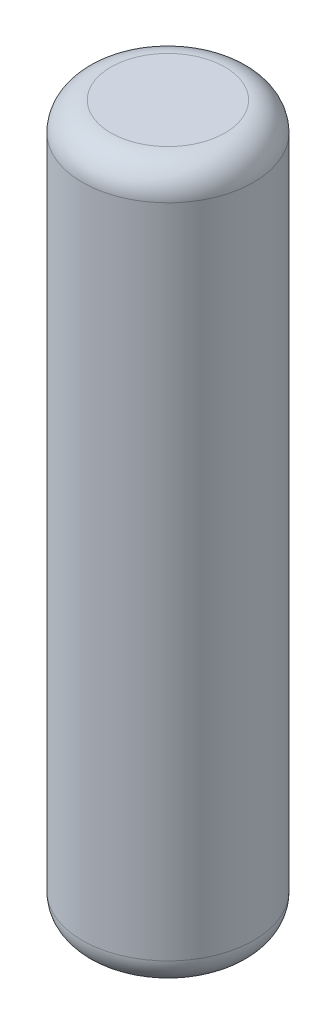
ISO-10303-21;
HEADER;
FILE_DESCRIPTION(('STEP AP214'),'2;1');
FILE_NAME('part.step','',(''),(''),'','','');
FILE_SCHEMA(('AUTOMOTIVE_DESIGN { 1 0 10303 214 1 1 1 1 }'));
ENDSEC;
DATA;
#1=APPLICATION_CONTEXT('core data for automotive mechanical design processes');
#2=APPLICATION_PROTOCOL_DEFINITION('international standard','automotive_design',2000,#1);
#3=PRODUCT_CONTEXT('',#1,'mechanical');
#4=PRODUCT('Part','Part','',(#3));
#5=PRODUCT_RELATED_PRODUCT_CATEGORY('part','',(#4));
#6=PRODUCT_DEFINITION_FORMATION('','',#4);
#7=PRODUCT_DEFINITION_CONTEXT('part definition',#1,'design');
#8=PRODUCT_DEFINITION('design','',#6,#7);
#9=PRODUCT_DEFINITION_SHAPE('','',#8);
#10=(LENGTH_UNIT() NAMED_UNIT(*) SI_UNIT(.MILLI.,.METRE.));
#11=(NAMED_UNIT(*) PLANE_ANGLE_UNIT() SI_UNIT($,.RADIAN.));
#12=(NAMED_UNIT(*) SI_UNIT($,.STERADIAN.) SOLID_ANGLE_UNIT());
#13=UNCERTAINTY_MEASURE_WITH_UNIT(LENGTH_MEASURE(1.E-05),#10,'distance_accuracy_value','');
#14=(GEOMETRIC_REPRESENTATION_CONTEXT(3) GLOBAL_UNCERTAINTY_ASSIGNED_CONTEXT((#13)) GLOBAL_UNIT_ASSIGNED_CONTEXT((#10,
#11,#12)) REPRESENTATION_CONTEXT('',''));
#15=CARTESIAN_POINT('',(0.,0.,0.));
#16=DIRECTION('',(0.,0.,1.));
#17=DIRECTION('',(1.,0.,0.));
#18=AXIS2_PLACEMENT_3D('',#15,#16,#17);
#19=CARTESIAN_POINT('',(0.,250.,0.));
#20=DIRECTION('',(0.,-1.,0.));
#21=DIRECTION('',(0.,0.,-1.));
#22=AXIS2_PLACEMENT_3D('',#19,#20,#21);
#23=CYLINDRICAL_SURFACE('',#22,30.);
#24=CARTESIAN_POINT('',(0.,10.,0.));
#25=DIRECTION('',(0.,1.,0.));
#26=DIRECTION('',(0.,0.,1.));
#27=AXIS2_PLACEMENT_3D('',#24,#25,#26);
#28=CIRCLE('',#27,30.);
#29=CARTESIAN_POINT('',(0.,10.,30.));
#30=VERTEX_POINT('',#29);
#31=EDGE_CURVE('E45',#30,#30,#28,.T.);
#32=ORIENTED_EDGE('',*,*,#31,.T.);
#33=EDGE_LOOP('',(#32));
#34=FACE_BOUND('',#33,.T.);
#35=CARTESIAN_POINT('',(0.,240.,0.));
#36=DIRECTION('',(0.,1.,0.));
#37=DIRECTION('',(0.,0.,1.));
#38=AXIS2_PLACEMENT_3D('',#35,#36,#37);
#39=CIRCLE('',#38,30.);
#40=CARTESIAN_POINT('',(0.,240.,30.));
#41=VERTEX_POINT('',#40);
#42=EDGE_CURVE('E49',#41,#41,#39,.F.);
#43=ORIENTED_EDGE('',*,*,#42,.T.);
#44=EDGE_LOOP('',(#43));
#45=FACE_BOUND('',#44,.T.);
#46=ADVANCED_FACE('F34',(#34,#45),#23,.T.);
#47=CARTESIAN_POINT('',(0.,250.,0.));
#48=DIRECTION('',(0.,1.,0.));
#49=DIRECTION('',(0.,0.,1.));
#50=AXIS2_PLACEMENT_3D('',#47,#48,#49);
#51=PLANE('',#50);
#52=CARTESIAN_POINT('',(0.,250.,0.));
#53=DIRECTION('',(0.,1.,0.));
#54=DIRECTION('',(0.,0.,1.));
#55=AXIS2_PLACEMENT_3D('',#52,#53,#54);
#56=CIRCLE('',#55,20.);
#57=CARTESIAN_POINT('',(0.,250.,20.));
#58=VERTEX_POINT('',#57);
#59=EDGE_CURVE('E10',#58,#58,#56,.T.);
#60=ORIENTED_EDGE('',*,*,#59,.T.);
#61=EDGE_LOOP('',(#60));
#62=FACE_BOUND('',#61,.T.);
#63=ADVANCED_FACE('F65',(#62),#51,.T.);
#64=CARTESIAN_POINT('',(0.,0.,0.));
#65=DIRECTION('',(0.,1.,0.));
#66=DIRECTION('',(0.,0.,1.));
#67=AXIS2_PLACEMENT_3D('',#64,#65,#66);
#68=PLANE('',#67);
#69=CARTESIAN_POINT('',(0.,0.,0.));
#70=DIRECTION('',(0.,1.,0.));
#71=DIRECTION('',(0.,0.,1.));
#72=AXIS2_PLACEMENT_3D('',#69,#70,#71);
#73=CIRCLE('',#72,20.);
#74=CARTESIAN_POINT('',(0.,0.,20.));
#75=VERTEX_POINT('',#74);
#76=EDGE_CURVE('E41',#75,#75,#73,.F.);
#77=ORIENTED_EDGE('',*,*,#76,.T.);
#78=EDGE_LOOP('',(#77));
#79=FACE_BOUND('',#78,.T.);
#80=ADVANCED_FACE('F62',(#79),#68,.F.);
#81=CARTESIAN_POINT('',(0.,10.,0.));
#82=DIRECTION('',(0.,1.,0.));
#83=DIRECTION('',(0.,0.,1.));
#84=AXIS2_PLACEMENT_3D('',#81,#82,#83);
#85=TOROIDAL_SURFACE('',#84,20.,10.);
#86=ORIENTED_EDGE('',*,*,#76,.F.);
#87=EDGE_LOOP('',(#86));
#88=FACE_BOUND('',#87,.T.);
#89=ORIENTED_EDGE('',*,*,#31,.F.);
#90=EDGE_LOOP('',(#89));
#91=FACE_BOUND('',#90,.T.);
#92=ADVANCED_FACE('F58',(#88,#91),#85,.T.);
#93=CARTESIAN_POINT('',(0.,240.,0.));
#94=DIRECTION('',(0.,1.,0.));
#95=DIRECTION('',(0.,0.,1.));
#96=AXIS2_PLACEMENT_3D('',#93,#94,#95);
#97=TOROIDAL_SURFACE('',#96,20.,10.);
#98=ORIENTED_EDGE('',*,*,#42,.F.);
#99=EDGE_LOOP('',(#98));
#100=FACE_BOUND('',#99,.T.);
#101=ORIENTED_EDGE('',*,*,#59,.F.);
#102=EDGE_LOOP('',(#101));
#103=FACE_BOUND('',#102,.T.);
#104=ADVANCED_FACE('F36',(#100,#103),#97,.T.);
#105=CLOSED_SHELL('',(#46,#63,#80,#92,#104));
#106=MANIFOLD_SOLID_BREP('B2',#105);
#107=ADVANCED_BREP_SHAPE_REPRESENTATION('',(#18,#106),#14);
#108=SHAPE_DEFINITION_REPRESENTATION(#9,#107);
ENDSEC;
END-ISO-10303-21;
